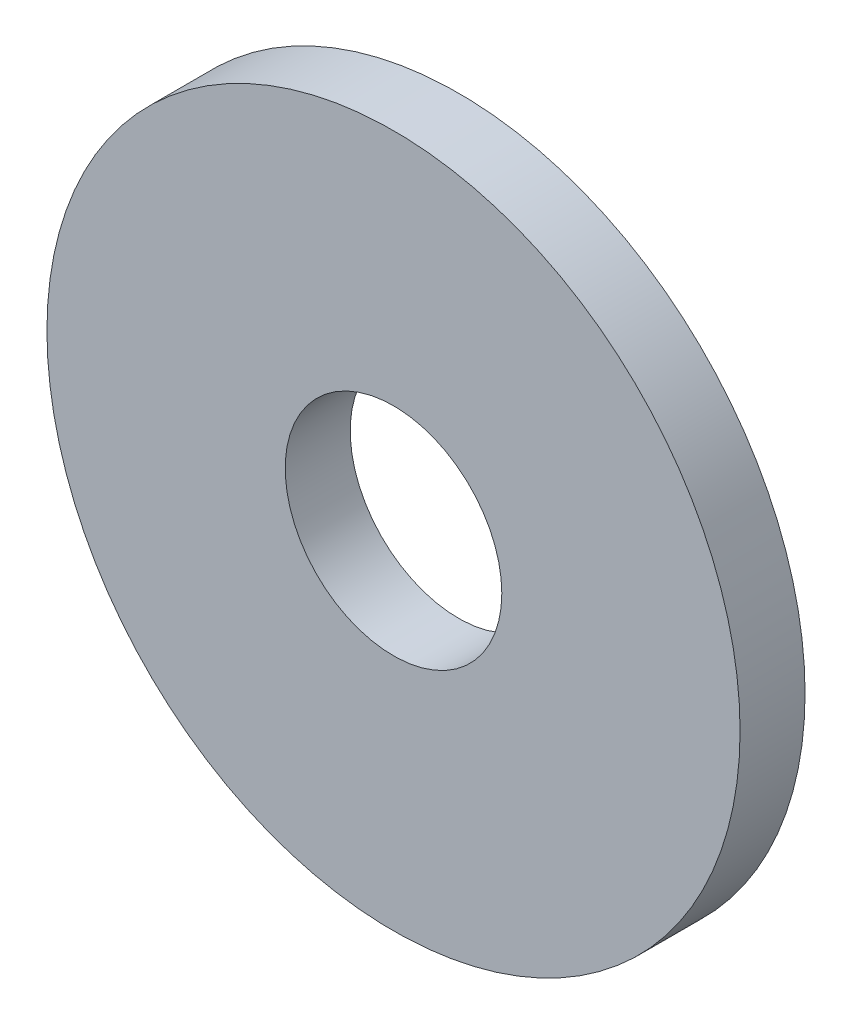
ISO-10303-21;
HEADER;
FILE_DESCRIPTION(('STEP AP214'),'2;1');
FILE_NAME('part.step','',(''),(''),'','','');
FILE_SCHEMA(('AUTOMOTIVE_DESIGN { 1 0 10303 214 1 1 1 1 }'));
ENDSEC;
DATA;
#1=APPLICATION_CONTEXT('core data for automotive mechanical design processes');
#2=APPLICATION_PROTOCOL_DEFINITION('international standard','automotive_design',2000,#1);
#3=PRODUCT_CONTEXT('',#1,'mechanical');
#4=PRODUCT('Part','Part','',(#3));
#5=PRODUCT_RELATED_PRODUCT_CATEGORY('part','',(#4));
#6=PRODUCT_DEFINITION_FORMATION('','',#4);
#7=PRODUCT_DEFINITION_CONTEXT('part definition',#1,'design');
#8=PRODUCT_DEFINITION('design','',#6,#7);
#9=PRODUCT_DEFINITION_SHAPE('','',#8);
#10=(LENGTH_UNIT() NAMED_UNIT(*) SI_UNIT(.MILLI.,.METRE.));
#11=(NAMED_UNIT(*) PLANE_ANGLE_UNIT() SI_UNIT($,.RADIAN.));
#12=(NAMED_UNIT(*) SI_UNIT($,.STERADIAN.) SOLID_ANGLE_UNIT());
#13=UNCERTAINTY_MEASURE_WITH_UNIT(LENGTH_MEASURE(1.E-05),#10,'distance_accuracy_value','');
#14=(GEOMETRIC_REPRESENTATION_CONTEXT(3) GLOBAL_UNCERTAINTY_ASSIGNED_CONTEXT((#13)) GLOBAL_UNIT_ASSIGNED_CONTEXT((#10,
#11,#12)) REPRESENTATION_CONTEXT('',''));
#15=CARTESIAN_POINT('',(0.,0.,0.));
#16=DIRECTION('',(0.,0.,1.));
#17=DIRECTION('',(1.,0.,0.));
#18=AXIS2_PLACEMENT_3D('',#15,#16,#17);
#19=CARTESIAN_POINT('',(0.,0.,3.));
#20=DIRECTION('',(0.,0.,1.));
#21=DIRECTION('',(1.,0.,0.));
#22=AXIS2_PLACEMENT_3D('',#19,#20,#21);
#23=PLANE('',#22);
#24=CARTESIAN_POINT('',(0.,0.,3.));
#25=DIRECTION('',(0.,0.,1.));
#26=DIRECTION('',(1.,0.,0.));
#27=AXIS2_PLACEMENT_3D('',#24,#25,#26);
#28=CIRCLE('',#27,16.);
#29=CARTESIAN_POINT('',(16.,0.,3.));
#30=VERTEX_POINT('',#29);
#31=EDGE_CURVE('E10',#30,#30,#28,.T.);
#32=ORIENTED_EDGE('',*,*,#31,.T.);
#33=EDGE_LOOP('',(#32));
#34=FACE_BOUND('',#33,.T.);
#35=CARTESIAN_POINT('',(0.,0.,3.));
#36=DIRECTION('',(0.,0.,1.));
#37=DIRECTION('',(1.,0.,0.));
#38=AXIS2_PLACEMENT_3D('',#35,#36,#37);
#39=CIRCLE('',#38,5.);
#40=CARTESIAN_POINT('',(5.,0.,3.));
#41=VERTEX_POINT('',#40);
#42=EDGE_CURVE('E41',#41,#41,#39,.T.);
#43=ORIENTED_EDGE('',*,*,#42,.F.);
#44=EDGE_LOOP('',(#43));
#45=FACE_BOUND('',#44,.T.);
#46=ADVANCED_FACE('F30',(#34,#45),#23,.T.);
#47=CARTESIAN_POINT('',(0.,0.,0.));
#48=DIRECTION('',(0.,0.,1.));
#49=DIRECTION('',(1.,0.,0.));
#50=AXIS2_PLACEMENT_3D('',#47,#48,#49);
#51=PLANE('',#50);
#52=CARTESIAN_POINT('',(0.,0.,0.));
#53=DIRECTION('',(0.,0.,1.));
#54=DIRECTION('',(1.,0.,0.));
#55=AXIS2_PLACEMENT_3D('',#52,#53,#54);
#56=CIRCLE('',#55,16.);
#57=CARTESIAN_POINT('',(16.,0.,0.));
#58=VERTEX_POINT('',#57);
#59=EDGE_CURVE('E34',#58,#58,#56,.T.);
#60=ORIENTED_EDGE('',*,*,#59,.F.);
#61=EDGE_LOOP('',(#60));
#62=FACE_BOUND('',#61,.T.);
#63=CARTESIAN_POINT('',(0.,0.,0.));
#64=DIRECTION('',(0.,0.,1.));
#65=DIRECTION('',(1.,0.,0.));
#66=AXIS2_PLACEMENT_3D('',#63,#64,#65);
#67=CIRCLE('',#66,5.);
#68=CARTESIAN_POINT('',(5.,0.,0.));
#69=VERTEX_POINT('',#68);
#70=EDGE_CURVE('E43',#69,#69,#67,.T.);
#71=ORIENTED_EDGE('',*,*,#70,.T.);
#72=EDGE_LOOP('',(#71));
#73=FACE_BOUND('',#72,.T.);
#74=ADVANCED_FACE('F53',(#62,#73),#51,.F.);
#75=CARTESIAN_POINT('',(0.,0.,3.));
#76=DIRECTION('',(0.,0.,-1.));
#77=DIRECTION('',(-1.,0.,0.));
#78=AXIS2_PLACEMENT_3D('',#75,#76,#77);
#79=CYLINDRICAL_SURFACE('',#78,16.);
#80=ORIENTED_EDGE('',*,*,#31,.F.);
#81=EDGE_LOOP('',(#80));
#82=FACE_BOUND('',#81,.T.);
#83=ORIENTED_EDGE('',*,*,#59,.T.);
#84=EDGE_LOOP('',(#83));
#85=FACE_BOUND('',#84,.T.);
#86=ADVANCED_FACE('F32',(#82,#85),#79,.T.);
#87=CARTESIAN_POINT('',(0.,0.,3.));
#88=DIRECTION('',(0.,0.,-1.));
#89=DIRECTION('',(-1.,0.,0.));
#90=AXIS2_PLACEMENT_3D('',#87,#88,#89);
#91=CYLINDRICAL_SURFACE('',#90,5.);
#92=ORIENTED_EDGE('',*,*,#42,.T.);
#93=EDGE_LOOP('',(#92));
#94=FACE_BOUND('',#93,.T.);
#95=ORIENTED_EDGE('',*,*,#70,.F.);
#96=EDGE_LOOP('',(#95));
#97=FACE_BOUND('',#96,.T.);
#98=ADVANCED_FACE('F49',(#94,#97),#91,.F.);
#99=CLOSED_SHELL('',(#46,#74,#86,#98));
#100=MANIFOLD_SOLID_BREP('B2',#99);
#101=ADVANCED_BREP_SHAPE_REPRESENTATION('',(#18,#100),#14);
#102=SHAPE_DEFINITION_REPRESENTATION(#9,#101);
ENDSEC;
END-ISO-10303-21;
